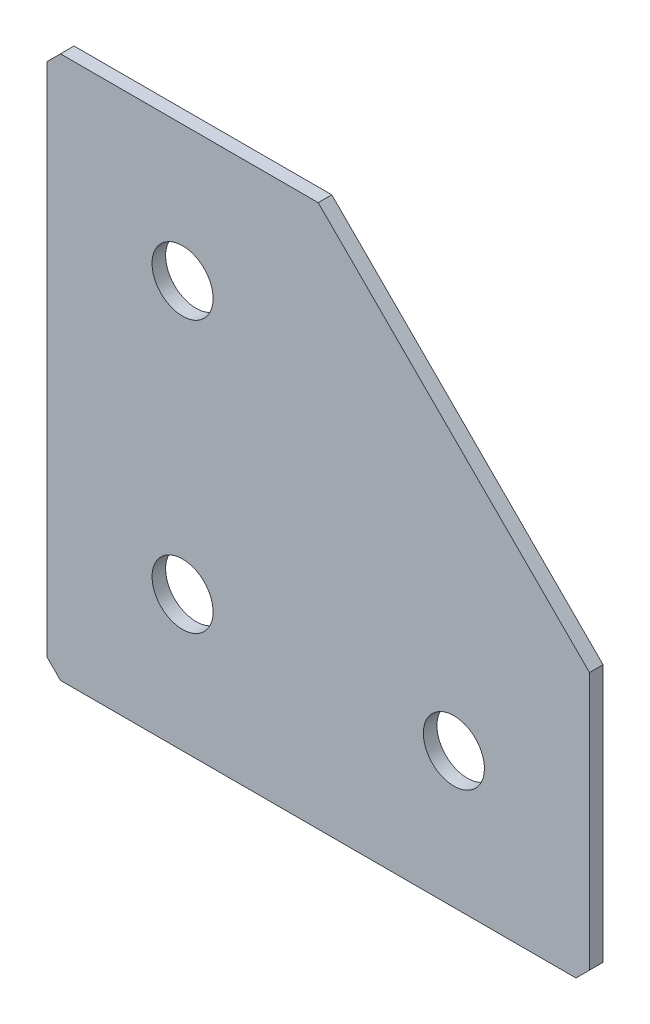
ISO-10303-21;
HEADER;
FILE_DESCRIPTION(('STEP AP214'),'2;1');
FILE_NAME('part.step','',(''),(''),'','','');
FILE_SCHEMA(('AUTOMOTIVE_DESIGN { 1 0 10303 214 1 1 1 1 }'));
ENDSEC;
DATA;
#1=APPLICATION_CONTEXT('core data for automotive mechanical design processes');
#2=APPLICATION_PROTOCOL_DEFINITION('international standard','automotive_design',2000,#1);
#3=PRODUCT_CONTEXT('',#1,'mechanical');
#4=PRODUCT('Part','Part','',(#3));
#5=PRODUCT_RELATED_PRODUCT_CATEGORY('part','',(#4));
#6=PRODUCT_DEFINITION_FORMATION('','',#4);
#7=PRODUCT_DEFINITION_CONTEXT('part definition',#1,'design');
#8=PRODUCT_DEFINITION('design','',#6,#7);
#9=PRODUCT_DEFINITION_SHAPE('','',#8);
#10=(LENGTH_UNIT() NAMED_UNIT(*) SI_UNIT(.MILLI.,.METRE.));
#11=(NAMED_UNIT(*) PLANE_ANGLE_UNIT() SI_UNIT($,.RADIAN.));
#12=(NAMED_UNIT(*) SI_UNIT($,.STERADIAN.) SOLID_ANGLE_UNIT());
#13=UNCERTAINTY_MEASURE_WITH_UNIT(LENGTH_MEASURE(1.E-05),#10,'distance_accuracy_value','');
#14=(GEOMETRIC_REPRESENTATION_CONTEXT(3) GLOBAL_UNCERTAINTY_ASSIGNED_CONTEXT((#13)) GLOBAL_UNIT_ASSIGNED_CONTEXT((#10,
#11,#12)) REPRESENTATION_CONTEXT('',''));
#15=CARTESIAN_POINT('',(0.,0.,0.));
#16=DIRECTION('',(0.,0.,1.));
#17=DIRECTION('',(1.,0.,0.));
#18=AXIS2_PLACEMENT_3D('',#15,#16,#17);
#19=CARTESIAN_POINT('',(40.,0.,-2.));
#20=DIRECTION('',(0.,-1.,0.));
#21=DIRECTION('',(1.,0.,0.));
#22=AXIS2_PLACEMENT_3D('',#19,#20,#21);
#23=PLANE('',#22);
#24=DIRECTION('',(1.,0.,0.));
#25=VECTOR('',#24,1.);
#26=CARTESIAN_POINT('',(40.,0.,-2.));
#27=LINE('',#26,#25);
#28=CARTESIAN_POINT('',(2.,0.,-2.));
#29=VERTEX_POINT('',#28);
#30=CARTESIAN_POINT('',(40.,0.,-2.));
#31=VERTEX_POINT('',#30);
#32=EDGE_CURVE('E110',#29,#31,#27,.T.);
#33=ORIENTED_EDGE('',*,*,#32,.F.);
#34=DIRECTION('',(0.,0.,1.));
#35=VECTOR('',#34,1.);
#36=CARTESIAN_POINT('',(2.,0.,-2.));
#37=LINE('',#36,#35);
#38=CARTESIAN_POINT('',(2.,0.,0.));
#39=VERTEX_POINT('',#38);
#40=EDGE_CURVE('E139',#29,#39,#37,.T.);
#41=ORIENTED_EDGE('',*,*,#40,.T.);
#42=DIRECTION('',(1.,0.,0.));
#43=VECTOR('',#42,1.);
#44=CARTESIAN_POINT('',(40.,0.,0.));
#45=LINE('',#44,#43);
#46=CARTESIAN_POINT('',(40.,0.,0.));
#47=VERTEX_POINT('',#46);
#48=EDGE_CURVE('E136',#39,#47,#45,.T.);
#49=ORIENTED_EDGE('',*,*,#48,.T.);
#50=DIRECTION('',(0.,0.,1.));
#51=VECTOR('',#50,1.);
#52=CARTESIAN_POINT('',(40.,0.,-2.));
#53=LINE('',#52,#51);
#54=EDGE_CURVE('E128',#31,#47,#53,.T.);
#55=ORIENTED_EDGE('',*,*,#54,.F.);
#56=EDGE_LOOP('',(#33,#41,#49,#55));
#57=FACE_BOUND('',#56,.T.);
#58=ADVANCED_FACE('F45',(#57),#23,.F.);
#59=CARTESIAN_POINT('',(80.,-40.,-2.));
#60=DIRECTION('',(-0.707106781186548,-0.707106781186547,0.));
#61=DIRECTION('',(0.707106781186547,-0.707106781186548,0.));
#62=AXIS2_PLACEMENT_3D('',#59,#60,#61);
#63=PLANE('',#62);
#64=DIRECTION('',(0.707106781186547,-0.707106781186548,0.));
#65=VECTOR('',#64,1.);
#66=CARTESIAN_POINT('',(80.,-40.,0.));
#67=LINE('',#66,#65);
#68=CARTESIAN_POINT('',(80.,-40.,0.));
#69=VERTEX_POINT('',#68);
#70=EDGE_CURVE('E197',#47,#69,#67,.T.);
#71=ORIENTED_EDGE('',*,*,#70,.T.);
#72=DIRECTION('',(0.,0.,1.));
#73=VECTOR('',#72,1.);
#74=CARTESIAN_POINT('',(80.,-40.,-2.));
#75=LINE('',#74,#73);
#76=CARTESIAN_POINT('',(80.,-40.,-2.));
#77=VERTEX_POINT('',#76);
#78=EDGE_CURVE('E130',#77,#69,#75,.T.);
#79=ORIENTED_EDGE('',*,*,#78,.F.);
#80=DIRECTION('',(0.707106781186547,-0.707106781186548,0.));
#81=VECTOR('',#80,1.);
#82=CARTESIAN_POINT('',(80.,-40.,-2.));
#83=LINE('',#82,#81);
#84=EDGE_CURVE('E114',#31,#77,#83,.T.);
#85=ORIENTED_EDGE('',*,*,#84,.F.);
#86=ORIENTED_EDGE('',*,*,#54,.T.);
#87=EDGE_LOOP('',(#71,#79,#85,#86));
#88=FACE_BOUND('',#87,.T.);
#89=ADVANCED_FACE('F127',(#88),#63,.F.);
#90=CARTESIAN_POINT('',(80.,-80.,-2.));
#91=DIRECTION('',(-1.,0.,0.));
#92=DIRECTION('',(0.,0.,1.));
#93=AXIS2_PLACEMENT_3D('',#90,#91,#92);
#94=PLANE('',#93);
#95=DIRECTION('',(0.,-1.,0.));
#96=VECTOR('',#95,1.);
#97=CARTESIAN_POINT('',(80.,-80.,0.));
#98=LINE('',#97,#96);
#99=CARTESIAN_POINT('',(80.,-78.,0.));
#100=VERTEX_POINT('',#99);
#101=EDGE_CURVE('E190',#69,#100,#98,.T.);
#102=ORIENTED_EDGE('',*,*,#101,.T.);
#103=DIRECTION('',(0.,0.,-1.));
#104=VECTOR('',#103,1.);
#105=CARTESIAN_POINT('',(80.,-78.,-2.));
#106=LINE('',#105,#104);
#107=CARTESIAN_POINT('',(80.,-78.,-2.));
#108=VERTEX_POINT('',#107);
#109=EDGE_CURVE('E11',#100,#108,#106,.T.);
#110=ORIENTED_EDGE('',*,*,#109,.T.);
#111=DIRECTION('',(0.,-1.,0.));
#112=VECTOR('',#111,1.);
#113=CARTESIAN_POINT('',(80.,-80.,-2.));
#114=LINE('',#113,#112);
#115=EDGE_CURVE('E133',#77,#108,#114,.T.);
#116=ORIENTED_EDGE('',*,*,#115,.F.);
#117=ORIENTED_EDGE('',*,*,#78,.T.);
#118=EDGE_LOOP('',(#102,#110,#116,#117));
#119=FACE_BOUND('',#118,.T.);
#120=ADVANCED_FACE('F266',(#119),#94,.F.);
#121=CARTESIAN_POINT('',(0.,-80.,-2.));
#122=DIRECTION('',(0.,1.,0.));
#123=DIRECTION('',(0.,0.,1.));
#124=AXIS2_PLACEMENT_3D('',#121,#122,#123);
#125=PLANE('',#124);
#126=DIRECTION('',(-1.,0.,0.));
#127=VECTOR('',#126,1.);
#128=CARTESIAN_POINT('',(0.,-80.,-2.));
#129=LINE('',#128,#127);
#130=CARTESIAN_POINT('',(78.,-80.,-2.));
#131=VERTEX_POINT('',#130);
#132=CARTESIAN_POINT('',(2.00000000000002,-80.,-2.));
#133=VERTEX_POINT('',#132);
#134=EDGE_CURVE('E182',#131,#133,#129,.T.);
#135=ORIENTED_EDGE('',*,*,#134,.F.);
#136=DIRECTION('',(0.,0.,1.));
#137=VECTOR('',#136,1.);
#138=CARTESIAN_POINT('',(78.,-80.,-2.));
#139=LINE('',#138,#137);
#140=CARTESIAN_POINT('',(78.,-80.,0.));
#141=VERTEX_POINT('',#140);
#142=EDGE_CURVE('E54',#131,#141,#139,.T.);
#143=ORIENTED_EDGE('',*,*,#142,.T.);
#144=DIRECTION('',(-1.,0.,0.));
#145=VECTOR('',#144,1.);
#146=CARTESIAN_POINT('',(0.,-80.,0.));
#147=LINE('',#146,#145);
#148=CARTESIAN_POINT('',(2.00000000000002,-80.,0.));
#149=VERTEX_POINT('',#148);
#150=EDGE_CURVE('E181',#141,#149,#147,.T.);
#151=ORIENTED_EDGE('',*,*,#150,.T.);
#152=DIRECTION('',(0.,0.,-1.));
#153=VECTOR('',#152,1.);
#154=CARTESIAN_POINT('',(2.00000000000002,-80.,-2.));
#155=LINE('',#154,#153);
#156=EDGE_CURVE('E61',#149,#133,#155,.T.);
#157=ORIENTED_EDGE('',*,*,#156,.T.);
#158=EDGE_LOOP('',(#135,#143,#151,#157));
#159=FACE_BOUND('',#158,.T.);
#160=ADVANCED_FACE('F180',(#159),#125,.F.);
#161=CARTESIAN_POINT('',(0.,0.,-2.));
#162=DIRECTION('',(1.,0.,0.));
#163=DIRECTION('',(0.,0.,-1.));
#164=AXIS2_PLACEMENT_3D('',#161,#162,#163);
#165=PLANE('',#164);
#166=DIRECTION('',(0.,1.,0.));
#167=VECTOR('',#166,1.);
#168=CARTESIAN_POINT('',(0.,0.,0.));
#169=LINE('',#168,#167);
#170=CARTESIAN_POINT('',(0.,-78.,0.));
#171=VERTEX_POINT('',#170);
#172=CARTESIAN_POINT('',(0.,-2.00000000000002,0.));
#173=VERTEX_POINT('',#172);
#174=EDGE_CURVE('E123',#171,#173,#169,.T.);
#175=ORIENTED_EDGE('',*,*,#174,.T.);
#176=DIRECTION('',(0.,0.,-1.));
#177=VECTOR('',#176,1.);
#178=CARTESIAN_POINT('',(0.,-2.00000000000002,-2.));
#179=LINE('',#178,#177);
#180=CARTESIAN_POINT('',(0.,-2.00000000000002,-2.));
#181=VERTEX_POINT('',#180);
#182=EDGE_CURVE('E163',#173,#181,#179,.T.);
#183=ORIENTED_EDGE('',*,*,#182,.T.);
#184=DIRECTION('',(0.,1.,0.));
#185=VECTOR('',#184,1.);
#186=CARTESIAN_POINT('',(0.,0.,-2.));
#187=LINE('',#186,#185);
#188=CARTESIAN_POINT('',(0.,-78.,-2.));
#189=VERTEX_POINT('',#188);
#190=EDGE_CURVE('E147',#189,#181,#187,.T.);
#191=ORIENTED_EDGE('',*,*,#190,.F.);
#192=DIRECTION('',(0.,0.,1.));
#193=VECTOR('',#192,1.);
#194=CARTESIAN_POINT('',(0.,-78.,-2.));
#195=LINE('',#194,#193);
#196=EDGE_CURVE('E159',#189,#171,#195,.T.);
#197=ORIENTED_EDGE('',*,*,#196,.T.);
#198=EDGE_LOOP('',(#175,#183,#191,#197));
#199=FACE_BOUND('',#198,.T.);
#200=ADVANCED_FACE('F241',(#199),#165,.F.);
#201=CARTESIAN_POINT('',(0.,0.,-2.));
#202=DIRECTION('',(0.,0.,1.));
#203=DIRECTION('',(1.,0.,0.));
#204=AXIS2_PLACEMENT_3D('',#201,#202,#203);
#205=PLANE('',#204);
#206=CARTESIAN_POINT('',(20.,-60.,-2.));
#207=DIRECTION('',(0.,0.,-1.));
#208=DIRECTION('',(0.,1.,0.));
#209=AXIS2_PLACEMENT_3D('',#206,#207,#208);
#210=CIRCLE('',#209,4.5);
#211=CARTESIAN_POINT('',(20.,-55.5,-2.));
#212=VERTEX_POINT('',#211);
#213=EDGE_CURVE('E230',#212,#212,#210,.T.);
#214=ORIENTED_EDGE('',*,*,#213,.F.);
#215=EDGE_LOOP('',(#214));
#216=FACE_BOUND('',#215,.T.);
#217=CARTESIAN_POINT('',(20.,-20.,-2.));
#218=DIRECTION('',(0.,0.,-1.));
#219=DIRECTION('',(0.,1.,0.));
#220=AXIS2_PLACEMENT_3D('',#217,#218,#219);
#221=CIRCLE('',#220,4.5);
#222=CARTESIAN_POINT('',(20.,-15.5,-2.));
#223=VERTEX_POINT('',#222);
#224=EDGE_CURVE('E222',#223,#223,#221,.T.);
#225=ORIENTED_EDGE('',*,*,#224,.F.);
#226=EDGE_LOOP('',(#225));
#227=FACE_BOUND('',#226,.T.);
#228=CARTESIAN_POINT('',(60.,-60.,-2.));
#229=DIRECTION('',(0.,0.,-1.));
#230=DIRECTION('',(0.,1.,0.));
#231=AXIS2_PLACEMENT_3D('',#228,#229,#230);
#232=CIRCLE('',#231,4.5);
#233=CARTESIAN_POINT('',(60.,-55.5,-2.));
#234=VERTEX_POINT('',#233);
#235=EDGE_CURVE('E214',#234,#234,#232,.T.);
#236=ORIENTED_EDGE('',*,*,#235,.F.);
#237=EDGE_LOOP('',(#236));
#238=FACE_BOUND('',#237,.T.);
#239=ORIENTED_EDGE('',*,*,#190,.T.);
#240=DIRECTION('',(-0.707106781186545,-0.70710678118655,0.));
#241=VECTOR('',#240,1.);
#242=CARTESIAN_POINT('',(2.,0.,-2.));
#243=LINE('',#242,#241);
#244=EDGE_CURVE('E117',#181,#29,#243,.F.);
#245=ORIENTED_EDGE('',*,*,#244,.T.);
#246=ORIENTED_EDGE('',*,*,#32,.T.);
#247=ORIENTED_EDGE('',*,*,#84,.T.);
#248=ORIENTED_EDGE('',*,*,#115,.T.);
#249=DIRECTION('',(0.707106781186545,0.70710678118655,0.));
#250=VECTOR('',#249,1.);
#251=CARTESIAN_POINT('',(78.,-80.,-2.));
#252=LINE('',#251,#250);
#253=EDGE_CURVE('E68',#108,#131,#252,.F.);
#254=ORIENTED_EDGE('',*,*,#253,.T.);
#255=ORIENTED_EDGE('',*,*,#134,.T.);
#256=DIRECTION('',(0.70710678118655,-0.707106781186545,0.));
#257=VECTOR('',#256,1.);
#258=CARTESIAN_POINT('',(0.,-78.,-2.));
#259=LINE('',#258,#257);
#260=EDGE_CURVE('E166',#133,#189,#259,.F.);
#261=ORIENTED_EDGE('',*,*,#260,.T.);
#262=EDGE_LOOP('',(#239,#245,#246,#247,#248,#254,#255,#261));
#263=FACE_BOUND('',#262,.T.);
#264=ADVANCED_FACE('F113',(#216,#227,#238,#263),#205,.F.);
#265=CARTESIAN_POINT('',(0.,0.,0.));
#266=DIRECTION('',(0.,0.,1.));
#267=DIRECTION('',(1.,0.,0.));
#268=AXIS2_PLACEMENT_3D('',#265,#266,#267);
#269=PLANE('',#268);
#270=CARTESIAN_POINT('',(20.,-60.,0.));
#271=DIRECTION('',(0.,0.,-1.));
#272=DIRECTION('',(0.,1.,0.));
#273=AXIS2_PLACEMENT_3D('',#270,#271,#272);
#274=CIRCLE('',#273,4.5);
#275=CARTESIAN_POINT('',(20.,-55.5,0.));
#276=VERTEX_POINT('',#275);
#277=EDGE_CURVE('E226',#276,#276,#274,.T.);
#278=ORIENTED_EDGE('',*,*,#277,.T.);
#279=EDGE_LOOP('',(#278));
#280=FACE_BOUND('',#279,.T.);
#281=CARTESIAN_POINT('',(20.,-20.,0.));
#282=DIRECTION('',(0.,0.,-1.));
#283=DIRECTION('',(0.,1.,0.));
#284=AXIS2_PLACEMENT_3D('',#281,#282,#283);
#285=CIRCLE('',#284,4.5);
#286=CARTESIAN_POINT('',(20.,-15.5,0.));
#287=VERTEX_POINT('',#286);
#288=EDGE_CURVE('E218',#287,#287,#285,.T.);
#289=ORIENTED_EDGE('',*,*,#288,.T.);
#290=EDGE_LOOP('',(#289));
#291=FACE_BOUND('',#290,.T.);
#292=CARTESIAN_POINT('',(60.,-60.,0.));
#293=DIRECTION('',(0.,0.,-1.));
#294=DIRECTION('',(0.,1.,0.));
#295=AXIS2_PLACEMENT_3D('',#292,#293,#294);
#296=CIRCLE('',#295,4.5);
#297=CARTESIAN_POINT('',(60.,-55.5,0.));
#298=VERTEX_POINT('',#297);
#299=EDGE_CURVE('E204',#298,#298,#296,.T.);
#300=ORIENTED_EDGE('',*,*,#299,.T.);
#301=EDGE_LOOP('',(#300));
#302=FACE_BOUND('',#301,.T.);
#303=ORIENTED_EDGE('',*,*,#48,.F.);
#304=DIRECTION('',(0.707106781186545,0.70710678118655,0.));
#305=VECTOR('',#304,1.);
#306=CARTESIAN_POINT('',(1.00000000000001,-1.,0.));
#307=LINE('',#306,#305);
#308=EDGE_CURVE('E156',#39,#173,#307,.F.);
#309=ORIENTED_EDGE('',*,*,#308,.T.);
#310=ORIENTED_EDGE('',*,*,#174,.F.);
#311=DIRECTION('',(-0.70710678118655,0.707106781186545,0.));
#312=VECTOR('',#311,1.);
#313=CARTESIAN_POINT('',(-39.,-39.0000000000003,0.));
#314=LINE('',#313,#312);
#315=EDGE_CURVE('E145',#171,#149,#314,.F.);
#316=ORIENTED_EDGE('',*,*,#315,.T.);
#317=ORIENTED_EDGE('',*,*,#150,.F.);
#318=DIRECTION('',(-0.707106781186545,-0.70710678118655,0.));
#319=VECTOR('',#318,1.);
#320=CARTESIAN_POINT('',(79.0000000000003,-78.9999999999997,0.));
#321=LINE('',#320,#319);
#322=EDGE_CURVE('E153',#141,#100,#321,.F.);
#323=ORIENTED_EDGE('',*,*,#322,.T.);
#324=ORIENTED_EDGE('',*,*,#101,.F.);
#325=ORIENTED_EDGE('',*,*,#70,.F.);
#326=EDGE_LOOP('',(#303,#309,#310,#316,#317,#323,#324,#325));
#327=FACE_BOUND('',#326,.T.);
#328=ADVANCED_FACE('F185',(#280,#291,#302,#327),#269,.T.);
#329=CARTESIAN_POINT('',(60.,-60.,-2.));
#330=DIRECTION('',(0.,0.,-1.));
#331=DIRECTION('',(0.,1.,0.));
#332=AXIS2_PLACEMENT_3D('',#329,#330,#331);
#333=CYLINDRICAL_SURFACE('',#332,4.5);
#334=ORIENTED_EDGE('',*,*,#299,.F.);
#335=EDGE_LOOP('',(#334));
#336=FACE_BOUND('',#335,.T.);
#337=ORIENTED_EDGE('',*,*,#235,.T.);
#338=EDGE_LOOP('',(#337));
#339=FACE_BOUND('',#338,.T.);
#340=ADVANCED_FACE('F247',(#336,#339),#333,.F.);
#341=CARTESIAN_POINT('',(20.,-20.,-2.));
#342=DIRECTION('',(0.,0.,-1.));
#343=DIRECTION('',(0.,1.,0.));
#344=AXIS2_PLACEMENT_3D('',#341,#342,#343);
#345=CYLINDRICAL_SURFACE('',#344,4.5);
#346=ORIENTED_EDGE('',*,*,#288,.F.);
#347=EDGE_LOOP('',(#346));
#348=FACE_BOUND('',#347,.T.);
#349=ORIENTED_EDGE('',*,*,#224,.T.);
#350=EDGE_LOOP('',(#349));
#351=FACE_BOUND('',#350,.T.);
#352=ADVANCED_FACE('F249',(#348,#351),#345,.F.);
#353=CARTESIAN_POINT('',(20.,-60.,-2.));
#354=DIRECTION('',(0.,0.,-1.));
#355=DIRECTION('',(0.,1.,0.));
#356=AXIS2_PLACEMENT_3D('',#353,#354,#355);
#357=CYLINDRICAL_SURFACE('',#356,4.5);
#358=ORIENTED_EDGE('',*,*,#277,.F.);
#359=EDGE_LOOP('',(#358));
#360=FACE_BOUND('',#359,.T.);
#361=ORIENTED_EDGE('',*,*,#213,.T.);
#362=EDGE_LOOP('',(#361));
#363=FACE_BOUND('',#362,.T.);
#364=ADVANCED_FACE('F237',(#360,#363),#357,.F.);
#365=CARTESIAN_POINT('',(2.,0.,-2.));
#366=DIRECTION('',(0.70710678118655,-0.707106781186545,0.));
#367=DIRECTION('',(0.,0.,1.));
#368=AXIS2_PLACEMENT_3D('',#365,#366,#367);
#369=PLANE('',#368);
#370=ORIENTED_EDGE('',*,*,#244,.F.);
#371=ORIENTED_EDGE('',*,*,#182,.F.);
#372=ORIENTED_EDGE('',*,*,#308,.F.);
#373=ORIENTED_EDGE('',*,*,#40,.F.);
#374=EDGE_LOOP('',(#370,#371,#372,#373));
#375=FACE_BOUND('',#374,.T.);
#376=ADVANCED_FACE('F270',(#375),#369,.F.);
#377=CARTESIAN_POINT('',(78.,-80.,-2.));
#378=DIRECTION('',(-0.70710678118655,0.707106781186545,0.));
#379=DIRECTION('',(0.,0.,1.));
#380=AXIS2_PLACEMENT_3D('',#377,#378,#379);
#381=PLANE('',#380);
#382=ORIENTED_EDGE('',*,*,#253,.F.);
#383=ORIENTED_EDGE('',*,*,#109,.F.);
#384=ORIENTED_EDGE('',*,*,#322,.F.);
#385=ORIENTED_EDGE('',*,*,#142,.F.);
#386=EDGE_LOOP('',(#382,#383,#384,#385));
#387=FACE_BOUND('',#386,.T.);
#388=ADVANCED_FACE('F272',(#387),#381,.F.);
#389=CARTESIAN_POINT('',(0.,-78.,-2.));
#390=DIRECTION('',(0.707106781186545,0.70710678118655,0.));
#391=DIRECTION('',(0.,0.,1.));
#392=AXIS2_PLACEMENT_3D('',#389,#390,#391);
#393=PLANE('',#392);
#394=ORIENTED_EDGE('',*,*,#260,.F.);
#395=ORIENTED_EDGE('',*,*,#156,.F.);
#396=ORIENTED_EDGE('',*,*,#315,.F.);
#397=ORIENTED_EDGE('',*,*,#196,.F.);
#398=EDGE_LOOP('',(#394,#395,#396,#397));
#399=FACE_BOUND('',#398,.T.);
#400=ADVANCED_FACE('F47',(#399),#393,.F.);
#401=CLOSED_SHELL('',(#58,#89,#120,#160,#200,#264,#328,#340,#352,#364,#376,#388,#400));
#402=MANIFOLD_SOLID_BREP('B2',#401);
#403=ADVANCED_BREP_SHAPE_REPRESENTATION('',(#18,#402),#14);
#404=SHAPE_DEFINITION_REPRESENTATION(#9,#403);
ENDSEC;
END-ISO-10303-21;
